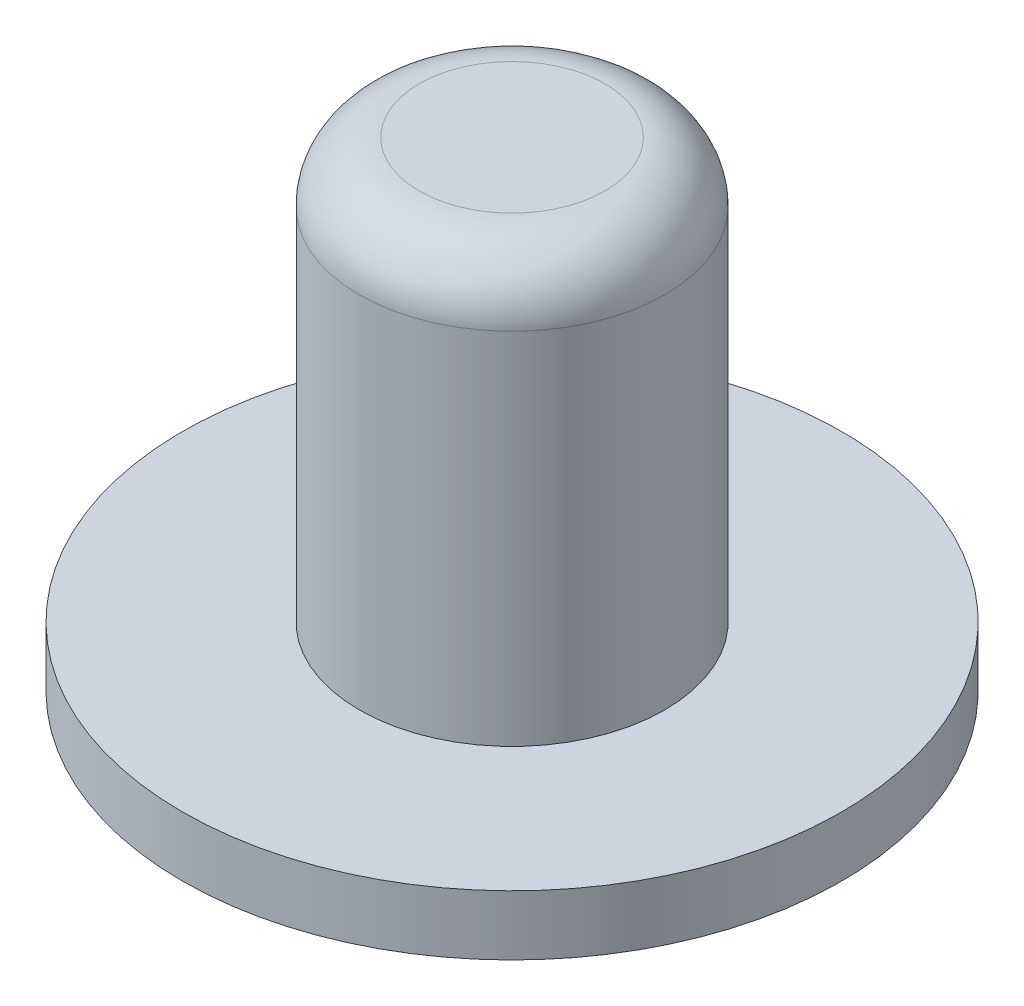
ISO-10303-21;
HEADER;
FILE_DESCRIPTION(('STEP AP214'),'2;1');
FILE_NAME('part.step','',(''),(''),'','','');
FILE_SCHEMA(('AUTOMOTIVE_DESIGN { 1 0 10303 214 1 1 1 1 }'));
ENDSEC;
DATA;
#1=APPLICATION_CONTEXT('core data for automotive mechanical design processes');
#2=APPLICATION_PROTOCOL_DEFINITION('international standard','automotive_design',2000,#1);
#3=PRODUCT_CONTEXT('',#1,'mechanical');
#4=PRODUCT('Part','Part','',(#3));
#5=PRODUCT_RELATED_PRODUCT_CATEGORY('part','',(#4));
#6=PRODUCT_DEFINITION_FORMATION('','',#4);
#7=PRODUCT_DEFINITION_CONTEXT('part definition',#1,'design');
#8=PRODUCT_DEFINITION('design','',#6,#7);
#9=PRODUCT_DEFINITION_SHAPE('','',#8);
#10=(LENGTH_UNIT() NAMED_UNIT(*) SI_UNIT(.MILLI.,.METRE.));
#11=(NAMED_UNIT(*) PLANE_ANGLE_UNIT() SI_UNIT($,.RADIAN.));
#12=(NAMED_UNIT(*) SI_UNIT($,.STERADIAN.) SOLID_ANGLE_UNIT());
#13=UNCERTAINTY_MEASURE_WITH_UNIT(LENGTH_MEASURE(1.E-05),#10,'distance_accuracy_value','');
#14=(GEOMETRIC_REPRESENTATION_CONTEXT(3) GLOBAL_UNCERTAINTY_ASSIGNED_CONTEXT((#13)) GLOBAL_UNIT_ASSIGNED_CONTEXT((#10,
#11,#12)) REPRESENTATION_CONTEXT('',''));
#15=CARTESIAN_POINT('',(0.,0.,0.));
#16=DIRECTION('',(0.,0.,1.));
#17=DIRECTION('',(1.,0.,0.));
#18=AXIS2_PLACEMENT_3D('',#15,#16,#17);
#19=CARTESIAN_POINT('',(0.,7.,0.));
#20=DIRECTION('',(0.,-1.,0.));
#21=DIRECTION('',(0.,0.,-1.));
#22=AXIS2_PLACEMENT_3D('',#19,#20,#21);
#23=CYLINDRICAL_SURFACE('',#22,2.55);
#24=CARTESIAN_POINT('',(0.,6.,0.));
#25=DIRECTION('',(0.,1.,0.));
#26=DIRECTION('',(0.,0.,1.));
#27=AXIS2_PLACEMENT_3D('',#24,#25,#26);
#28=CIRCLE('',#27,2.55);
#29=CARTESIAN_POINT('',(0.,6.,2.55));
#30=VERTEX_POINT('',#29);
#31=EDGE_CURVE('E10',#30,#30,#28,.F.);
#32=ORIENTED_EDGE('',*,*,#31,.T.);
#33=EDGE_LOOP('',(#32));
#34=FACE_BOUND('',#33,.T.);
#35=CARTESIAN_POINT('',(0.,0.,0.));
#36=DIRECTION('',(0.,1.,0.));
#37=DIRECTION('',(0.,0.,1.));
#38=AXIS2_PLACEMENT_3D('',#35,#36,#37);
#39=CIRCLE('',#38,2.55);
#40=CARTESIAN_POINT('',(0.,0.,2.55));
#41=VERTEX_POINT('',#40);
#42=EDGE_CURVE('E44',#41,#41,#39,.T.);
#43=ORIENTED_EDGE('',*,*,#42,.T.);
#44=EDGE_LOOP('',(#43));
#45=FACE_BOUND('',#44,.T.);
#46=ADVANCED_FACE('F33',(#34,#45),#23,.T.);
#47=CARTESIAN_POINT('',(0.,7.,0.));
#48=DIRECTION('',(0.,1.,0.));
#49=DIRECTION('',(0.,0.,1.));
#50=AXIS2_PLACEMENT_3D('',#47,#48,#49);
#51=PLANE('',#50);
#52=CARTESIAN_POINT('',(0.,7.,0.));
#53=DIRECTION('',(0.,1.,0.));
#54=DIRECTION('',(0.,0.,1.));
#55=AXIS2_PLACEMENT_3D('',#52,#53,#54);
#56=CIRCLE('',#55,1.55);
#57=CARTESIAN_POINT('',(0.,7.,1.55));
#58=VERTEX_POINT('',#57);
#59=EDGE_CURVE('E40',#58,#58,#56,.T.);
#60=ORIENTED_EDGE('',*,*,#59,.T.);
#61=EDGE_LOOP('',(#60));
#62=FACE_BOUND('',#61,.T.);
#63=ADVANCED_FACE('F70',(#62),#51,.T.);
#64=CARTESIAN_POINT('',(0.,-1.,0.));
#65=DIRECTION('',(0.,1.,0.));
#66=DIRECTION('',(0.,0.,1.));
#67=AXIS2_PLACEMENT_3D('',#64,#65,#66);
#68=CYLINDRICAL_SURFACE('',#67,5.5);
#69=CARTESIAN_POINT('',(0.,-1.,0.));
#70=DIRECTION('',(0.,1.,0.));
#71=DIRECTION('',(0.,0.,1.));
#72=AXIS2_PLACEMENT_3D('',#69,#70,#71);
#73=CIRCLE('',#72,5.5);
#74=CARTESIAN_POINT('',(0.,-1.,5.5));
#75=VERTEX_POINT('',#74);
#76=EDGE_CURVE('E48',#75,#75,#73,.T.);
#77=ORIENTED_EDGE('',*,*,#76,.T.);
#78=EDGE_LOOP('',(#77));
#79=FACE_BOUND('',#78,.T.);
#80=CARTESIAN_POINT('',(0.,0.,0.));
#81=DIRECTION('',(0.,1.,0.));
#82=DIRECTION('',(0.,0.,1.));
#83=AXIS2_PLACEMENT_3D('',#80,#81,#82);
#84=CIRCLE('',#83,5.5);
#85=CARTESIAN_POINT('',(0.,0.,5.5));
#86=VERTEX_POINT('',#85);
#87=EDGE_CURVE('E51',#86,#86,#84,.T.);
#88=ORIENTED_EDGE('',*,*,#87,.F.);
#89=EDGE_LOOP('',(#88));
#90=FACE_BOUND('',#89,.T.);
#91=ADVANCED_FACE('F57',(#79,#90),#68,.T.);
#92=CARTESIAN_POINT('',(0.,-1.,0.));
#93=DIRECTION('',(0.,1.,0.));
#94=DIRECTION('',(0.,0.,1.));
#95=AXIS2_PLACEMENT_3D('',#92,#93,#94);
#96=PLANE('',#95);
#97=ORIENTED_EDGE('',*,*,#76,.F.);
#98=EDGE_LOOP('',(#97));
#99=FACE_BOUND('',#98,.T.);
#100=ADVANCED_FACE('F60',(#99),#96,.F.);
#101=CARTESIAN_POINT('',(0.,0.,0.));
#102=DIRECTION('',(0.,1.,0.));
#103=DIRECTION('',(0.,0.,1.));
#104=AXIS2_PLACEMENT_3D('',#101,#102,#103);
#105=PLANE('',#104);
#106=ORIENTED_EDGE('',*,*,#42,.F.);
#107=EDGE_LOOP('',(#106));
#108=FACE_BOUND('',#107,.T.);
#109=ORIENTED_EDGE('',*,*,#87,.T.);
#110=EDGE_LOOP('',(#109));
#111=FACE_BOUND('',#110,.T.);
#112=ADVANCED_FACE('F62',(#108,#111),#105,.T.);
#113=CARTESIAN_POINT('',(0.,6.,0.));
#114=DIRECTION('',(0.,1.,0.));
#115=DIRECTION('',(0.,0.,1.));
#116=AXIS2_PLACEMENT_3D('',#113,#114,#115);
#117=TOROIDAL_SURFACE('',#116,1.55,1.);
#118=ORIENTED_EDGE('',*,*,#31,.F.);
#119=EDGE_LOOP('',(#118));
#120=FACE_BOUND('',#119,.T.);
#121=ORIENTED_EDGE('',*,*,#59,.F.);
#122=EDGE_LOOP('',(#121));
#123=FACE_BOUND('',#122,.T.);
#124=ADVANCED_FACE('F35',(#120,#123),#117,.T.);
#125=CLOSED_SHELL('',(#46,#63,#91,#100,#112,#124));
#126=MANIFOLD_SOLID_BREP('B2',#125);
#127=ADVANCED_BREP_SHAPE_REPRESENTATION('',(#18,#126),#14);
#128=SHAPE_DEFINITION_REPRESENTATION(#9,#127);
ENDSEC;
END-ISO-10303-21;
